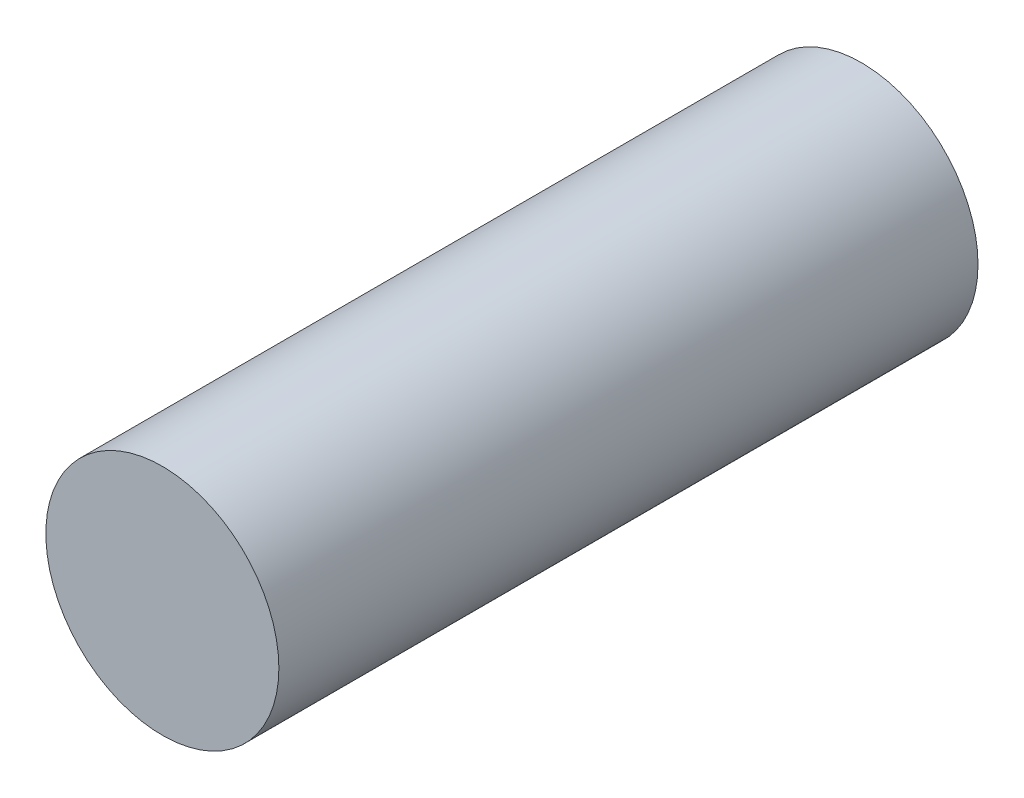
ISO-10303-21;
HEADER;
FILE_DESCRIPTION(('STEP AP214'),'2;1');
FILE_NAME('part.step','',(''),(''),'','','');
FILE_SCHEMA(('AUTOMOTIVE_DESIGN { 1 0 10303 214 1 1 1 1 }'));
ENDSEC;
DATA;
#1=APPLICATION_CONTEXT('core data for automotive mechanical design processes');
#2=APPLICATION_PROTOCOL_DEFINITION('international standard','automotive_design',2000,#1);
#3=PRODUCT_CONTEXT('',#1,'mechanical');
#4=PRODUCT('Part','Part','',(#3));
#5=PRODUCT_RELATED_PRODUCT_CATEGORY('part','',(#4));
#6=PRODUCT_DEFINITION_FORMATION('','',#4);
#7=PRODUCT_DEFINITION_CONTEXT('part definition',#1,'design');
#8=PRODUCT_DEFINITION('design','',#6,#7);
#9=PRODUCT_DEFINITION_SHAPE('','',#8);
#10=(LENGTH_UNIT() NAMED_UNIT(*) SI_UNIT(.MILLI.,.METRE.));
#11=(NAMED_UNIT(*) PLANE_ANGLE_UNIT() SI_UNIT($,.RADIAN.));
#12=(NAMED_UNIT(*) SI_UNIT($,.STERADIAN.) SOLID_ANGLE_UNIT());
#13=UNCERTAINTY_MEASURE_WITH_UNIT(LENGTH_MEASURE(1.E-05),#10,'distance_accuracy_value','');
#14=(GEOMETRIC_REPRESENTATION_CONTEXT(3) GLOBAL_UNCERTAINTY_ASSIGNED_CONTEXT((#13)) GLOBAL_UNIT_ASSIGNED_CONTEXT((#10,
#11,#12)) REPRESENTATION_CONTEXT('',''));
#15=CARTESIAN_POINT('',(0.,0.,0.));
#16=DIRECTION('',(0.,0.,1.));
#17=DIRECTION('',(1.,0.,0.));
#18=AXIS2_PLACEMENT_3D('',#15,#16,#17);
#19=CARTESIAN_POINT('',(0.,0.,18.));
#20=DIRECTION('',(0.,0.,-1.));
#21=DIRECTION('',(-1.,0.,0.));
#22=AXIS2_PLACEMENT_3D('',#19,#20,#21);
#23=CYLINDRICAL_SURFACE('',#22,3.);
#24=CARTESIAN_POINT('',(0.,0.,18.));
#25=DIRECTION('',(0.,0.,1.));
#26=DIRECTION('',(1.,0.,0.));
#27=AXIS2_PLACEMENT_3D('',#24,#25,#26);
#28=CIRCLE('',#27,3.);
#29=CARTESIAN_POINT('',(3.,0.,18.));
#30=VERTEX_POINT('',#29);
#31=EDGE_CURVE('E10',#30,#30,#28,.T.);
#32=ORIENTED_EDGE('',*,*,#31,.F.);
#33=EDGE_LOOP('',(#32));
#34=FACE_BOUND('',#33,.T.);
#35=CARTESIAN_POINT('',(0.,0.,0.));
#36=DIRECTION('',(0.,0.,1.));
#37=DIRECTION('',(1.,0.,0.));
#38=AXIS2_PLACEMENT_3D('',#35,#36,#37);
#39=CIRCLE('',#38,3.);
#40=CARTESIAN_POINT('',(3.,0.,0.));
#41=VERTEX_POINT('',#40);
#42=EDGE_CURVE('E34',#41,#41,#39,.T.);
#43=ORIENTED_EDGE('',*,*,#42,.T.);
#44=EDGE_LOOP('',(#43));
#45=FACE_BOUND('',#44,.T.);
#46=ADVANCED_FACE('F31',(#34,#45),#23,.T.);
#47=CARTESIAN_POINT('',(0.,0.,18.));
#48=DIRECTION('',(0.,0.,1.));
#49=DIRECTION('',(1.,0.,0.));
#50=AXIS2_PLACEMENT_3D('',#47,#48,#49);
#51=PLANE('',#50);
#52=ORIENTED_EDGE('',*,*,#31,.T.);
#53=EDGE_LOOP('',(#52));
#54=FACE_BOUND('',#53,.T.);
#55=ADVANCED_FACE('F46',(#54),#51,.T.);
#56=CARTESIAN_POINT('',(0.,0.,0.));
#57=DIRECTION('',(0.,0.,1.));
#58=DIRECTION('',(1.,0.,0.));
#59=AXIS2_PLACEMENT_3D('',#56,#57,#58);
#60=PLANE('',#59);
#61=ORIENTED_EDGE('',*,*,#42,.F.);
#62=EDGE_LOOP('',(#61));
#63=FACE_BOUND('',#62,.T.);
#64=ADVANCED_FACE('F44',(#63),#60,.F.);
#65=CLOSED_SHELL('',(#46,#55,#64));
#66=MANIFOLD_SOLID_BREP('B2',#65);
#67=ADVANCED_BREP_SHAPE_REPRESENTATION('',(#18,#66),#14);
#68=SHAPE_DEFINITION_REPRESENTATION(#9,#67);
ENDSEC;
END-ISO-10303-21;
